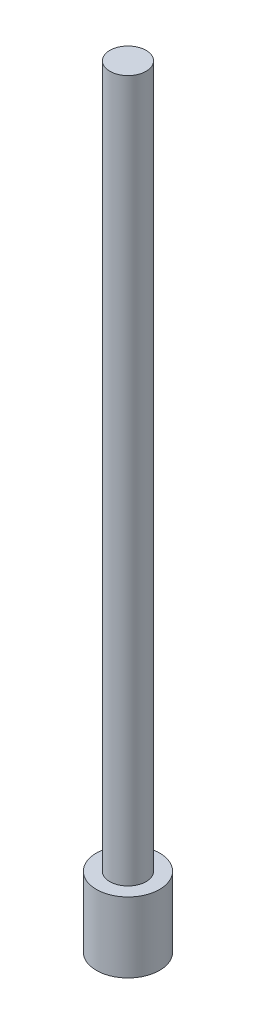
ISO-10303-21;
HEADER;
FILE_DESCRIPTION(('STEP AP214'),'2;1');
FILE_NAME('part.step','',(''),(''),'','','');
FILE_SCHEMA(('AUTOMOTIVE_DESIGN { 1 0 10303 214 1 1 1 1 }'));
ENDSEC;
DATA;
#1=APPLICATION_CONTEXT('core data for automotive mechanical design processes');
#2=APPLICATION_PROTOCOL_DEFINITION('international standard','automotive_design',2000,#1);
#3=PRODUCT_CONTEXT('',#1,'mechanical');
#4=PRODUCT('Part','Part','',(#3));
#5=PRODUCT_RELATED_PRODUCT_CATEGORY('part','',(#4));
#6=PRODUCT_DEFINITION_FORMATION('','',#4);
#7=PRODUCT_DEFINITION_CONTEXT('part definition',#1,'design');
#8=PRODUCT_DEFINITION('design','',#6,#7);
#9=PRODUCT_DEFINITION_SHAPE('','',#8);
#10=(LENGTH_UNIT() NAMED_UNIT(*) SI_UNIT(.MILLI.,.METRE.));
#11=(NAMED_UNIT(*) PLANE_ANGLE_UNIT() SI_UNIT($,.RADIAN.));
#12=(NAMED_UNIT(*) SI_UNIT($,.STERADIAN.) SOLID_ANGLE_UNIT());
#13=UNCERTAINTY_MEASURE_WITH_UNIT(LENGTH_MEASURE(1.E-05),#10,'distance_accuracy_value','');
#14=(GEOMETRIC_REPRESENTATION_CONTEXT(3) GLOBAL_UNCERTAINTY_ASSIGNED_CONTEXT((#13)) GLOBAL_UNIT_ASSIGNED_CONTEXT((#10,
#11,#12)) REPRESENTATION_CONTEXT('',''));
#15=CARTESIAN_POINT('',(0.,0.,0.));
#16=DIRECTION('',(0.,0.,1.));
#17=DIRECTION('',(1.,0.,0.));
#18=AXIS2_PLACEMENT_3D('',#15,#16,#17);
#19=CARTESIAN_POINT('',(0.,300.,0.));
#20=DIRECTION('',(0.,-1.,0.));
#21=DIRECTION('',(0.,0.,-1.));
#22=AXIS2_PLACEMENT_3D('',#19,#20,#21);
#23=CYLINDRICAL_SURFACE('',#22,7.75);
#24=CARTESIAN_POINT('',(0.,300.,0.));
#25=DIRECTION('',(0.,1.,0.));
#26=DIRECTION('',(0.,0.,1.));
#27=AXIS2_PLACEMENT_3D('',#24,#25,#26);
#28=CIRCLE('',#27,7.75);
#29=CARTESIAN_POINT('',(0.,300.,7.75));
#30=VERTEX_POINT('',#29);
#31=EDGE_CURVE('E10',#30,#30,#28,.T.);
#32=ORIENTED_EDGE('',*,*,#31,.F.);
#33=EDGE_LOOP('',(#32));
#34=FACE_BOUND('',#33,.T.);
#35=CARTESIAN_POINT('',(0.,0.,0.));
#36=DIRECTION('',(0.,1.,0.));
#37=DIRECTION('',(0.,0.,1.));
#38=AXIS2_PLACEMENT_3D('',#35,#36,#37);
#39=CIRCLE('',#38,7.75);
#40=CARTESIAN_POINT('',(0.,0.,7.75));
#41=VERTEX_POINT('',#40);
#42=EDGE_CURVE('E36',#41,#41,#39,.T.);
#43=ORIENTED_EDGE('',*,*,#42,.T.);
#44=EDGE_LOOP('',(#43));
#45=FACE_BOUND('',#44,.T.);
#46=ADVANCED_FACE('F33',(#34,#45),#23,.T.);
#47=CARTESIAN_POINT('',(0.,300.,0.));
#48=DIRECTION('',(0.,1.,0.));
#49=DIRECTION('',(0.,0.,1.));
#50=AXIS2_PLACEMENT_3D('',#47,#48,#49);
#51=PLANE('',#50);
#52=ORIENTED_EDGE('',*,*,#31,.T.);
#53=EDGE_LOOP('',(#52));
#54=FACE_BOUND('',#53,.T.);
#55=ADVANCED_FACE('F64',(#54),#51,.T.);
#56=CARTESIAN_POINT('',(0.,-30.,0.));
#57=DIRECTION('',(0.,1.,0.));
#58=DIRECTION('',(0.,0.,1.));
#59=AXIS2_PLACEMENT_3D('',#56,#57,#58);
#60=CYLINDRICAL_SURFACE('',#59,13.5);
#61=CARTESIAN_POINT('',(0.,-30.,0.));
#62=DIRECTION('',(0.,1.,0.));
#63=DIRECTION('',(0.,0.,1.));
#64=AXIS2_PLACEMENT_3D('',#61,#62,#63);
#65=CIRCLE('',#64,13.5);
#66=CARTESIAN_POINT('',(0.,-30.,13.5));
#67=VERTEX_POINT('',#66);
#68=EDGE_CURVE('E43',#67,#67,#65,.T.);
#69=ORIENTED_EDGE('',*,*,#68,.T.);
#70=EDGE_LOOP('',(#69));
#71=FACE_BOUND('',#70,.T.);
#72=CARTESIAN_POINT('',(0.,0.,0.));
#73=DIRECTION('',(0.,1.,0.));
#74=DIRECTION('',(0.,0.,1.));
#75=AXIS2_PLACEMENT_3D('',#72,#73,#74);
#76=CIRCLE('',#75,13.5);
#77=CARTESIAN_POINT('',(0.,0.,13.5));
#78=VERTEX_POINT('',#77);
#79=EDGE_CURVE('E45',#78,#78,#76,.T.);
#80=ORIENTED_EDGE('',*,*,#79,.F.);
#81=EDGE_LOOP('',(#80));
#82=FACE_BOUND('',#81,.T.);
#83=ADVANCED_FACE('F51',(#71,#82),#60,.T.);
#84=CARTESIAN_POINT('',(0.,-30.,0.));
#85=DIRECTION('',(0.,1.,0.));
#86=DIRECTION('',(0.,0.,1.));
#87=AXIS2_PLACEMENT_3D('',#84,#85,#86);
#88=PLANE('',#87);
#89=ORIENTED_EDGE('',*,*,#68,.F.);
#90=EDGE_LOOP('',(#89));
#91=FACE_BOUND('',#90,.T.);
#92=ADVANCED_FACE('F54',(#91),#88,.F.);
#93=CARTESIAN_POINT('',(0.,0.,0.));
#94=DIRECTION('',(0.,1.,0.));
#95=DIRECTION('',(0.,0.,1.));
#96=AXIS2_PLACEMENT_3D('',#93,#94,#95);
#97=PLANE('',#96);
#98=ORIENTED_EDGE('',*,*,#42,.F.);
#99=EDGE_LOOP('',(#98));
#100=FACE_BOUND('',#99,.T.);
#101=ORIENTED_EDGE('',*,*,#79,.T.);
#102=EDGE_LOOP('',(#101));
#103=FACE_BOUND('',#102,.T.);
#104=ADVANCED_FACE('F56',(#100,#103),#97,.T.);
#105=CLOSED_SHELL('',(#46,#55,#83,#92,#104));
#106=MANIFOLD_SOLID_BREP('B2',#105);
#107=ADVANCED_BREP_SHAPE_REPRESENTATION('',(#18,#106),#14);
#108=SHAPE_DEFINITION_REPRESENTATION(#9,#107);
ENDSEC;
END-ISO-10303-21;
